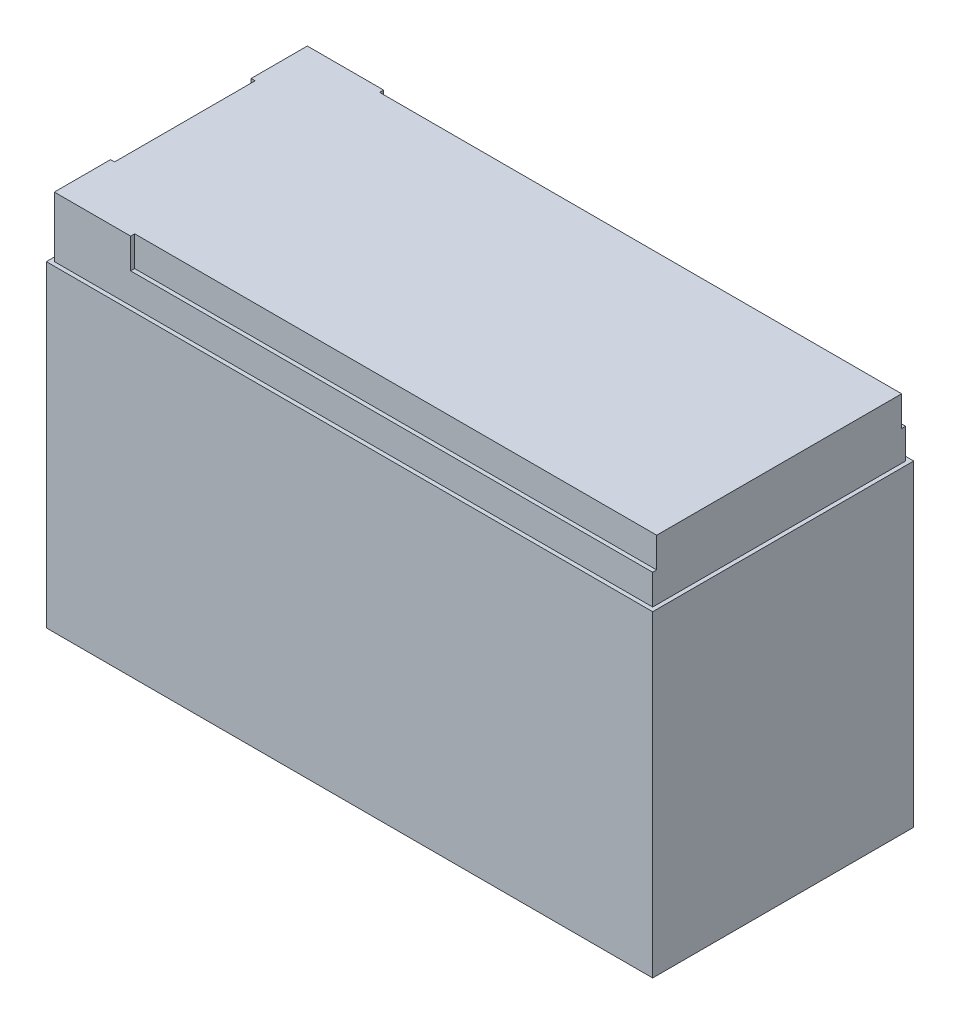
ISO-10303-21;
HEADER;
FILE_DESCRIPTION(('STEP AP214'),'2;1');
FILE_NAME('part.step','',(''),(''),'','','');
FILE_SCHEMA(('AUTOMOTIVE_DESIGN { 1 0 10303 214 1 1 1 1 }'));
ENDSEC;
DATA;
#1=APPLICATION_CONTEXT('core data for automotive mechanical design processes');
#2=APPLICATION_PROTOCOL_DEFINITION('international standard','automotive_design',2000,#1);
#3=PRODUCT_CONTEXT('',#1,'mechanical');
#4=PRODUCT('Part','Part','',(#3));
#5=PRODUCT_RELATED_PRODUCT_CATEGORY('part','',(#4));
#6=PRODUCT_DEFINITION_FORMATION('','',#4);
#7=PRODUCT_DEFINITION_CONTEXT('part definition',#1,'design');
#8=PRODUCT_DEFINITION('design','',#6,#7);
#9=PRODUCT_DEFINITION_SHAPE('','',#8);
#10=(LENGTH_UNIT() NAMED_UNIT(*) SI_UNIT(.MILLI.,.METRE.));
#11=(NAMED_UNIT(*) PLANE_ANGLE_UNIT() SI_UNIT($,.RADIAN.));
#12=(NAMED_UNIT(*) SI_UNIT($,.STERADIAN.) SOLID_ANGLE_UNIT());
#13=UNCERTAINTY_MEASURE_WITH_UNIT(LENGTH_MEASURE(1.E-05),#10,'distance_accuracy_value','');
#14=(GEOMETRIC_REPRESENTATION_CONTEXT(3) GLOBAL_UNCERTAINTY_ASSIGNED_CONTEXT((#13)) GLOBAL_UNIT_ASSIGNED_CONTEXT((#10,
#11,#12)) REPRESENTATION_CONTEXT('',''));
#15=CARTESIAN_POINT('',(0.,0.,0.));
#16=DIRECTION('',(0.,0.,1.));
#17=DIRECTION('',(1.,0.,0.));
#18=AXIS2_PLACEMENT_3D('',#15,#16,#17);
#19=CARTESIAN_POINT('',(75.5,94.,32.5));
#20=DIRECTION('',(-1.,0.,0.));
#21=DIRECTION('',(0.,0.,1.));
#22=AXIS2_PLACEMENT_3D('',#19,#20,#21);
#23=PLANE('',#22);
#24=DIRECTION('',(0.,0.,-1.));
#25=VECTOR('',#24,1.);
#26=CARTESIAN_POINT('',(75.5,79.,32.5));
#27=LINE('',#26,#25);
#28=CARTESIAN_POINT('',(75.5,79.,32.5));
#29=VERTEX_POINT('',#28);
#30=CARTESIAN_POINT('',(75.5,79.,-32.5));
#31=VERTEX_POINT('',#30);
#32=EDGE_CURVE('E269',#29,#31,#27,.T.);
#33=ORIENTED_EDGE('',*,*,#32,.F.);
#34=DIRECTION('',(0.,-1.,0.));
#35=VECTOR('',#34,1.);
#36=CARTESIAN_POINT('',(75.5,94.,32.5));
#37=LINE('',#36,#35);
#38=CARTESIAN_POINT('',(75.5,0.,32.5));
#39=VERTEX_POINT('',#38);
#40=EDGE_CURVE('E283',#29,#39,#37,.T.);
#41=ORIENTED_EDGE('',*,*,#40,.T.);
#42=DIRECTION('',(0.,0.,-1.));
#43=VECTOR('',#42,1.);
#44=CARTESIAN_POINT('',(75.5,0.,32.5));
#45=LINE('',#44,#43);
#46=CARTESIAN_POINT('',(75.5,0.,-32.5));
#47=VERTEX_POINT('',#46);
#48=EDGE_CURVE('E271',#39,#47,#45,.T.);
#49=ORIENTED_EDGE('',*,*,#48,.T.);
#50=DIRECTION('',(0.,-1.,0.));
#51=VECTOR('',#50,1.);
#52=CARTESIAN_POINT('',(75.5,94.,-32.5));
#53=LINE('',#52,#51);
#54=EDGE_CURVE('E11',#31,#47,#53,.T.);
#55=ORIENTED_EDGE('',*,*,#54,.F.);
#56=EDGE_LOOP('',(#33,#41,#49,#55));
#57=FACE_BOUND('',#56,.T.);
#58=ADVANCED_FACE('F32',(#57),#23,.F.);
#59=CARTESIAN_POINT('',(-75.5,94.,-32.5));
#60=DIRECTION('',(0.,0.,1.));
#61=DIRECTION('',(1.,0.,0.));
#62=AXIS2_PLACEMENT_3D('',#59,#60,#61);
#63=PLANE('',#62);
#64=DIRECTION('',(-1.,0.,0.));
#65=VECTOR('',#64,1.);
#66=CARTESIAN_POINT('',(75.5,79.,-32.5));
#67=LINE('',#66,#65);
#68=CARTESIAN_POINT('',(-75.5,79.,-32.5));
#69=VERTEX_POINT('',#68);
#70=EDGE_CURVE('E256',#31,#69,#67,.T.);
#71=ORIENTED_EDGE('',*,*,#70,.F.);
#72=ORIENTED_EDGE('',*,*,#54,.T.);
#73=DIRECTION('',(-1.,0.,0.));
#74=VECTOR('',#73,1.);
#75=CARTESIAN_POINT('',(-75.5,0.,-32.5));
#76=LINE('',#75,#74);
#77=CARTESIAN_POINT('',(-75.5,0.,-32.5));
#78=VERTEX_POINT('',#77);
#79=EDGE_CURVE('E274',#47,#78,#76,.T.);
#80=ORIENTED_EDGE('',*,*,#79,.T.);
#81=DIRECTION('',(0.,-1.,0.));
#82=VECTOR('',#81,1.);
#83=CARTESIAN_POINT('',(-75.5,94.,-32.5));
#84=LINE('',#83,#82);
#85=EDGE_CURVE('E39',#69,#78,#84,.T.);
#86=ORIENTED_EDGE('',*,*,#85,.F.);
#87=EDGE_LOOP('',(#71,#72,#80,#86));
#88=FACE_BOUND('',#87,.T.);
#89=ADVANCED_FACE('F296',(#88),#63,.F.);
#90=CARTESIAN_POINT('',(-75.5,94.,32.5));
#91=DIRECTION('',(1.,0.,0.));
#92=DIRECTION('',(0.,0.,-1.));
#93=AXIS2_PLACEMENT_3D('',#90,#91,#92);
#94=PLANE('',#93);
#95=DIRECTION('',(0.,0.,1.));
#96=VECTOR('',#95,1.);
#97=CARTESIAN_POINT('',(-75.5,79.,-32.5));
#98=LINE('',#97,#96);
#99=CARTESIAN_POINT('',(-75.5,79.,32.5));
#100=VERTEX_POINT('',#99);
#101=EDGE_CURVE('E265',#69,#100,#98,.T.);
#102=ORIENTED_EDGE('',*,*,#101,.F.);
#103=ORIENTED_EDGE('',*,*,#85,.T.);
#104=DIRECTION('',(0.,0.,1.));
#105=VECTOR('',#104,1.);
#106=CARTESIAN_POINT('',(-75.5,0.,32.5));
#107=LINE('',#106,#105);
#108=CARTESIAN_POINT('',(-75.5,0.,32.5));
#109=VERTEX_POINT('',#108);
#110=EDGE_CURVE('E277',#78,#109,#107,.T.);
#111=ORIENTED_EDGE('',*,*,#110,.T.);
#112=DIRECTION('',(0.,-1.,0.));
#113=VECTOR('',#112,1.);
#114=CARTESIAN_POINT('',(-75.5,94.,32.5));
#115=LINE('',#114,#113);
#116=EDGE_CURVE('E285',#100,#109,#115,.T.);
#117=ORIENTED_EDGE('',*,*,#116,.F.);
#118=EDGE_LOOP('',(#102,#103,#111,#117));
#119=FACE_BOUND('',#118,.T.);
#120=ADVANCED_FACE('F289',(#119),#94,.F.);
#121=CARTESIAN_POINT('',(-75.5,94.,32.5));
#122=DIRECTION('',(0.,0.,-1.));
#123=DIRECTION('',(-1.,0.,0.));
#124=AXIS2_PLACEMENT_3D('',#121,#122,#123);
#125=PLANE('',#124);
#126=DIRECTION('',(1.,0.,0.));
#127=VECTOR('',#126,1.);
#128=CARTESIAN_POINT('',(-75.5,79.,32.5));
#129=LINE('',#128,#127);
#130=EDGE_CURVE('E267',#100,#29,#129,.T.);
#131=ORIENTED_EDGE('',*,*,#130,.F.);
#132=ORIENTED_EDGE('',*,*,#116,.T.);
#133=DIRECTION('',(1.,0.,0.));
#134=VECTOR('',#133,1.);
#135=CARTESIAN_POINT('',(-75.5,0.,32.5));
#136=LINE('',#135,#134);
#137=EDGE_CURVE('E280',#109,#39,#136,.T.);
#138=ORIENTED_EDGE('',*,*,#137,.T.);
#139=ORIENTED_EDGE('',*,*,#40,.F.);
#140=EDGE_LOOP('',(#131,#132,#138,#139));
#141=FACE_BOUND('',#140,.T.);
#142=ADVANCED_FACE('F304',(#141),#125,.F.);
#143=CARTESIAN_POINT('',(0.,0.,0.));
#144=DIRECTION('',(0.,-1.,0.));
#145=DIRECTION('',(0.,0.,-1.));
#146=AXIS2_PLACEMENT_3D('',#143,#144,#145);
#147=PLANE('',#146);
#148=ORIENTED_EDGE('',*,*,#48,.F.);
#149=ORIENTED_EDGE('',*,*,#137,.F.);
#150=ORIENTED_EDGE('',*,*,#110,.F.);
#151=ORIENTED_EDGE('',*,*,#79,.F.);
#152=EDGE_LOOP('',(#148,#149,#150,#151));
#153=FACE_BOUND('',#152,.T.);
#154=ADVANCED_FACE('F300',(#153),#147,.T.);
#155=CARTESIAN_POINT('',(0.,79.,0.));
#156=DIRECTION('',(0.,1.,0.));
#157=DIRECTION('',(0.,0.,1.));
#158=AXIS2_PLACEMENT_3D('',#155,#156,#157);
#159=PLANE('',#158);
#160=DIRECTION('',(1.,0.,0.));
#161=VECTOR('',#160,1.);
#162=CARTESIAN_POINT('',(-74.5,79.,31.5));
#163=LINE('',#162,#161);
#164=CARTESIAN_POINT('',(-74.5,79.,31.5));
#165=VERTEX_POINT('',#164);
#166=CARTESIAN_POINT('',(74.5,79.,31.5));
#167=VERTEX_POINT('',#166);
#168=EDGE_CURVE('E241',#165,#167,#163,.T.);
#169=ORIENTED_EDGE('',*,*,#168,.F.);
#170=DIRECTION('',(0.,0.,1.));
#171=VECTOR('',#170,1.);
#172=CARTESIAN_POINT('',(-74.5,79.,31.5));
#173=LINE('',#172,#171);
#174=CARTESIAN_POINT('',(-74.5,79.,-31.5));
#175=VERTEX_POINT('',#174);
#176=EDGE_CURVE('E238',#175,#165,#173,.T.);
#177=ORIENTED_EDGE('',*,*,#176,.F.);
#178=DIRECTION('',(-1.,0.,0.));
#179=VECTOR('',#178,1.);
#180=CARTESIAN_POINT('',(-74.5,79.,-31.5));
#181=LINE('',#180,#179);
#182=CARTESIAN_POINT('',(74.5,79.,-31.5));
#183=VERTEX_POINT('',#182);
#184=EDGE_CURVE('E234',#183,#175,#181,.T.);
#185=ORIENTED_EDGE('',*,*,#184,.F.);
#186=DIRECTION('',(0.,0.,-1.));
#187=VECTOR('',#186,1.);
#188=CARTESIAN_POINT('',(74.5,79.,31.5));
#189=LINE('',#188,#187);
#190=EDGE_CURVE('E231',#167,#183,#189,.T.);
#191=ORIENTED_EDGE('',*,*,#190,.F.);
#192=EDGE_LOOP('',(#169,#177,#185,#191));
#193=FACE_BOUND('',#192,.T.);
#194=ORIENTED_EDGE('',*,*,#70,.T.);
#195=ORIENTED_EDGE('',*,*,#101,.T.);
#196=ORIENTED_EDGE('',*,*,#130,.T.);
#197=ORIENTED_EDGE('',*,*,#32,.T.);
#198=EDGE_LOOP('',(#194,#195,#196,#197));
#199=FACE_BOUND('',#198,.T.);
#200=ADVANCED_FACE('F307',(#193,#199),#159,.T.);
#201=CARTESIAN_POINT('',(74.5,79.,31.5));
#202=DIRECTION('',(1.,0.,0.));
#203=DIRECTION('',(0.,0.,-1.));
#204=AXIS2_PLACEMENT_3D('',#201,#202,#203);
#205=PLANE('',#204);
#206=DIRECTION('',(0.,1.,0.));
#207=VECTOR('',#206,1.);
#208=CARTESIAN_POINT('',(74.5,86.5,30.5));
#209=LINE('',#208,#207);
#210=CARTESIAN_POINT('',(74.5,86.5,30.5));
#211=VERTEX_POINT('',#210);
#212=CARTESIAN_POINT('',(74.5,94.,30.5));
#213=VERTEX_POINT('',#212);
#214=EDGE_CURVE('E54',#211,#213,#209,.T.);
#215=ORIENTED_EDGE('',*,*,#214,.F.);
#216=DIRECTION('',(0.,0.,-1.));
#217=VECTOR('',#216,1.);
#218=CARTESIAN_POINT('',(74.5,86.5,31.5));
#219=LINE('',#218,#217);
#220=CARTESIAN_POINT('',(74.5,86.5,31.5));
#221=VERTEX_POINT('',#220);
#222=EDGE_CURVE('E184',#221,#211,#219,.T.);
#223=ORIENTED_EDGE('',*,*,#222,.F.);
#224=DIRECTION('',(0.,1.,0.));
#225=VECTOR('',#224,1.);
#226=CARTESIAN_POINT('',(74.5,79.,31.5));
#227=LINE('',#226,#225);
#228=EDGE_CURVE('E253',#167,#221,#227,.T.);
#229=ORIENTED_EDGE('',*,*,#228,.F.);
#230=ORIENTED_EDGE('',*,*,#190,.T.);
#231=DIRECTION('',(0.,1.,0.));
#232=VECTOR('',#231,1.);
#233=CARTESIAN_POINT('',(74.5,79.,-31.5));
#234=LINE('',#233,#232);
#235=CARTESIAN_POINT('',(74.5,86.5,-31.5));
#236=VERTEX_POINT('',#235);
#237=EDGE_CURVE('E244',#183,#236,#234,.T.);
#238=ORIENTED_EDGE('',*,*,#237,.T.);
#239=DIRECTION('',(0.,0.,-1.));
#240=VECTOR('',#239,1.);
#241=CARTESIAN_POINT('',(74.5,86.5,-31.5));
#242=LINE('',#241,#240);
#243=CARTESIAN_POINT('',(74.5,86.5,-30.5));
#244=VERTEX_POINT('',#243);
#245=EDGE_CURVE('E207',#244,#236,#242,.T.);
#246=ORIENTED_EDGE('',*,*,#245,.F.);
#247=DIRECTION('',(0.,1.,0.));
#248=VECTOR('',#247,1.);
#249=CARTESIAN_POINT('',(74.5,86.5,-30.5));
#250=LINE('',#249,#248);
#251=CARTESIAN_POINT('',(74.5,94.,-30.5));
#252=VERTEX_POINT('',#251);
#253=EDGE_CURVE('E224',#244,#252,#250,.T.);
#254=ORIENTED_EDGE('',*,*,#253,.T.);
#255=DIRECTION('',(0.,0.,-1.));
#256=VECTOR('',#255,1.);
#257=CARTESIAN_POINT('',(74.5,94.,31.5));
#258=LINE('',#257,#256);
#259=EDGE_CURVE('E227',#213,#252,#258,.T.);
#260=ORIENTED_EDGE('',*,*,#259,.F.);
#261=EDGE_LOOP('',(#215,#223,#229,#230,#238,#246,#254,#260));
#262=FACE_BOUND('',#261,.T.);
#263=ADVANCED_FACE('F330',(#262),#205,.T.);
#264=CARTESIAN_POINT('',(-74.5,79.,31.5));
#265=DIRECTION('',(0.,0.,1.));
#266=DIRECTION('',(1.,0.,0.));
#267=AXIS2_PLACEMENT_3D('',#264,#265,#266);
#268=PLANE('',#267);
#269=DIRECTION('',(0.,1.,0.));
#270=VECTOR('',#269,1.);
#271=CARTESIAN_POINT('',(-55.5,86.5,31.5));
#272=LINE('',#271,#270);
#273=CARTESIAN_POINT('',(-55.5,86.5,31.5));
#274=VERTEX_POINT('',#273);
#275=CARTESIAN_POINT('',(-55.5,94.,31.5));
#276=VERTEX_POINT('',#275);
#277=EDGE_CURVE('E200',#274,#276,#272,.T.);
#278=ORIENTED_EDGE('',*,*,#277,.T.);
#279=DIRECTION('',(1.,0.,0.));
#280=VECTOR('',#279,1.);
#281=CARTESIAN_POINT('',(-74.5,94.,31.5));
#282=LINE('',#281,#280);
#283=CARTESIAN_POINT('',(-74.5,94.,31.5));
#284=VERTEX_POINT('',#283);
#285=EDGE_CURVE('E235',#284,#276,#282,.T.);
#286=ORIENTED_EDGE('',*,*,#285,.F.);
#287=DIRECTION('',(0.,1.,0.));
#288=VECTOR('',#287,1.);
#289=CARTESIAN_POINT('',(-74.5,79.,31.5));
#290=LINE('',#289,#288);
#291=EDGE_CURVE('E257',#165,#284,#290,.T.);
#292=ORIENTED_EDGE('',*,*,#291,.F.);
#293=ORIENTED_EDGE('',*,*,#168,.T.);
#294=ORIENTED_EDGE('',*,*,#228,.T.);
#295=DIRECTION('',(1.,0.,0.));
#296=VECTOR('',#295,1.);
#297=CARTESIAN_POINT('',(74.5,86.5,31.5));
#298=LINE('',#297,#296);
#299=EDGE_CURVE('E194',#274,#221,#298,.T.);
#300=ORIENTED_EDGE('',*,*,#299,.F.);
#301=EDGE_LOOP('',(#278,#286,#292,#293,#294,#300));
#302=FACE_BOUND('',#301,.T.);
#303=ADVANCED_FACE('F334',(#302),#268,.T.);
#304=CARTESIAN_POINT('',(-74.5,79.,31.5));
#305=DIRECTION('',(-1.,0.,0.));
#306=DIRECTION('',(0.,0.,1.));
#307=AXIS2_PLACEMENT_3D('',#304,#305,#306);
#308=PLANE('',#307);
#309=DIRECTION('',(0.,1.,0.));
#310=VECTOR('',#309,1.);
#311=CARTESIAN_POINT('',(-74.5,86.5,-17.5));
#312=LINE('',#311,#310);
#313=CARTESIAN_POINT('',(-74.5,86.5,-17.5));
#314=VERTEX_POINT('',#313);
#315=CARTESIAN_POINT('',(-74.5,94.,-17.5));
#316=VERTEX_POINT('',#315);
#317=EDGE_CURVE('E198',#314,#316,#312,.T.);
#318=ORIENTED_EDGE('',*,*,#317,.T.);
#319=DIRECTION('',(0.,0.,1.));
#320=VECTOR('',#319,1.);
#321=CARTESIAN_POINT('',(-74.5,94.,31.5));
#322=LINE('',#321,#320);
#323=CARTESIAN_POINT('',(-74.5,94.,-31.5));
#324=VERTEX_POINT('',#323);
#325=EDGE_CURVE('E248',#324,#316,#322,.T.);
#326=ORIENTED_EDGE('',*,*,#325,.F.);
#327=DIRECTION('',(0.,1.,0.));
#328=VECTOR('',#327,1.);
#329=CARTESIAN_POINT('',(-74.5,79.,-31.5));
#330=LINE('',#329,#328);
#331=EDGE_CURVE('E259',#175,#324,#330,.T.);
#332=ORIENTED_EDGE('',*,*,#331,.F.);
#333=ORIENTED_EDGE('',*,*,#176,.T.);
#334=ORIENTED_EDGE('',*,*,#291,.T.);
#335=CARTESIAN_POINT('',(-74.5,94.,17.5));
#336=VERTEX_POINT('',#335);
#337=EDGE_CURVE('E177',#336,#284,#322,.T.);
#338=ORIENTED_EDGE('',*,*,#337,.F.);
#339=DIRECTION('',(0.,1.,0.));
#340=VECTOR('',#339,1.);
#341=CARTESIAN_POINT('',(-74.5,86.5,17.5));
#342=LINE('',#341,#340);
#343=CARTESIAN_POINT('',(-74.5,86.5,17.5));
#344=VERTEX_POINT('',#343);
#345=EDGE_CURVE('E46',#344,#336,#342,.T.);
#346=ORIENTED_EDGE('',*,*,#345,.F.);
#347=DIRECTION('',(0.,0.,1.));
#348=VECTOR('',#347,1.);
#349=CARTESIAN_POINT('',(-74.5,86.5,-17.5));
#350=LINE('',#349,#348);
#351=EDGE_CURVE('E163',#314,#344,#350,.T.);
#352=ORIENTED_EDGE('',*,*,#351,.F.);
#353=EDGE_LOOP('',(#318,#326,#332,#333,#334,#338,#346,#352));
#354=FACE_BOUND('',#353,.T.);
#355=ADVANCED_FACE('F175',(#354),#308,.T.);
#356=CARTESIAN_POINT('',(-74.5,79.,-31.5));
#357=DIRECTION('',(0.,0.,-1.));
#358=DIRECTION('',(-1.,0.,0.));
#359=AXIS2_PLACEMENT_3D('',#356,#357,#358);
#360=PLANE('',#359);
#361=DIRECTION('',(0.,1.,0.));
#362=VECTOR('',#361,1.);
#363=CARTESIAN_POINT('',(-55.5,86.5,-31.5));
#364=LINE('',#363,#362);
#365=CARTESIAN_POINT('',(-55.5,86.5,-31.5));
#366=VERTEX_POINT('',#365);
#367=CARTESIAN_POINT('',(-55.5,94.,-31.5));
#368=VERTEX_POINT('',#367);
#369=EDGE_CURVE('E219',#366,#368,#364,.T.);
#370=ORIENTED_EDGE('',*,*,#369,.F.);
#371=DIRECTION('',(-1.,0.,0.));
#372=VECTOR('',#371,1.);
#373=CARTESIAN_POINT('',(74.5,86.5,-31.5));
#374=LINE('',#373,#372);
#375=EDGE_CURVE('E209',#236,#366,#374,.T.);
#376=ORIENTED_EDGE('',*,*,#375,.F.);
#377=ORIENTED_EDGE('',*,*,#237,.F.);
#378=ORIENTED_EDGE('',*,*,#184,.T.);
#379=ORIENTED_EDGE('',*,*,#331,.T.);
#380=DIRECTION('',(-1.,0.,0.));
#381=VECTOR('',#380,1.);
#382=CARTESIAN_POINT('',(-74.5,94.,-31.5));
#383=LINE('',#382,#381);
#384=EDGE_CURVE('E246',#368,#324,#383,.T.);
#385=ORIENTED_EDGE('',*,*,#384,.F.);
#386=EDGE_LOOP('',(#370,#376,#377,#378,#379,#385));
#387=FACE_BOUND('',#386,.T.);
#388=ADVANCED_FACE('F326',(#387),#360,.T.);
#389=CARTESIAN_POINT('',(0.,94.,0.));
#390=DIRECTION('',(0.,-1.,0.));
#391=DIRECTION('',(0.,0.,-1.));
#392=AXIS2_PLACEMENT_3D('',#389,#390,#391);
#393=PLANE('',#392);
#394=ORIENTED_EDGE('',*,*,#325,.T.);
#395=DIRECTION('',(-1.,0.,0.));
#396=VECTOR('',#395,1.);
#397=CARTESIAN_POINT('',(-74.5,94.,-17.5));
#398=LINE('',#397,#396);
#399=CARTESIAN_POINT('',(-73.5,94.,-17.5));
#400=VERTEX_POINT('',#399);
#401=EDGE_CURVE('E172',#400,#316,#398,.T.);
#402=ORIENTED_EDGE('',*,*,#401,.F.);
#403=DIRECTION('',(0.,0.,-1.));
#404=VECTOR('',#403,1.);
#405=CARTESIAN_POINT('',(-73.5,94.,-17.5));
#406=LINE('',#405,#404);
#407=CARTESIAN_POINT('',(-73.5,94.,17.5));
#408=VERTEX_POINT('',#407);
#409=EDGE_CURVE('E502',#408,#400,#406,.T.);
#410=ORIENTED_EDGE('',*,*,#409,.F.);
#411=DIRECTION('',(1.,0.,0.));
#412=VECTOR('',#411,1.);
#413=CARTESIAN_POINT('',(-74.5,94.,17.5));
#414=LINE('',#413,#412);
#415=EDGE_CURVE('E518',#336,#408,#414,.T.);
#416=ORIENTED_EDGE('',*,*,#415,.F.);
#417=ORIENTED_EDGE('',*,*,#337,.T.);
#418=ORIENTED_EDGE('',*,*,#285,.T.);
#419=DIRECTION('',(0.,0.,1.));
#420=VECTOR('',#419,1.);
#421=CARTESIAN_POINT('',(-55.5,94.,31.5));
#422=LINE('',#421,#420);
#423=CARTESIAN_POINT('',(-55.5,94.,30.5));
#424=VERTEX_POINT('',#423);
#425=EDGE_CURVE('E188',#424,#276,#422,.T.);
#426=ORIENTED_EDGE('',*,*,#425,.F.);
#427=DIRECTION('',(-1.,0.,0.));
#428=VECTOR('',#427,1.);
#429=CARTESIAN_POINT('',(74.5,94.,30.5));
#430=LINE('',#429,#428);
#431=EDGE_CURVE('E196',#213,#424,#430,.T.);
#432=ORIENTED_EDGE('',*,*,#431,.F.);
#433=ORIENTED_EDGE('',*,*,#259,.T.);
#434=DIRECTION('',(1.,0.,0.));
#435=VECTOR('',#434,1.);
#436=CARTESIAN_POINT('',(74.5,94.,-30.5));
#437=LINE('',#436,#435);
#438=CARTESIAN_POINT('',(-55.5,94.,-30.5));
#439=VERTEX_POINT('',#438);
#440=EDGE_CURVE('E210',#439,#252,#437,.T.);
#441=ORIENTED_EDGE('',*,*,#440,.F.);
#442=DIRECTION('',(0.,0.,1.));
#443=VECTOR('',#442,1.);
#444=CARTESIAN_POINT('',(-55.5,94.,-31.5));
#445=LINE('',#444,#443);
#446=EDGE_CURVE('E203',#368,#439,#445,.T.);
#447=ORIENTED_EDGE('',*,*,#446,.F.);
#448=ORIENTED_EDGE('',*,*,#384,.T.);
#449=EDGE_LOOP('',(#394,#402,#410,#416,#417,#418,#426,#432,#433,#441,#447,#448));
#450=FACE_BOUND('',#449,.T.);
#451=ADVANCED_FACE('F322',(#450),#393,.F.);
#452=CARTESIAN_POINT('',(74.5,86.5,-30.5));
#453=DIRECTION('',(0.,0.,1.));
#454=DIRECTION('',(1.,0.,0.));
#455=AXIS2_PLACEMENT_3D('',#452,#453,#454);
#456=PLANE('',#455);
#457=ORIENTED_EDGE('',*,*,#440,.T.);
#458=ORIENTED_EDGE('',*,*,#253,.F.);
#459=DIRECTION('',(1.,0.,0.));
#460=VECTOR('',#459,1.);
#461=CARTESIAN_POINT('',(74.5,86.5,-30.5));
#462=LINE('',#461,#460);
#463=CARTESIAN_POINT('',(-55.5,86.5,-30.5));
#464=VERTEX_POINT('',#463);
#465=EDGE_CURVE('E216',#464,#244,#462,.T.);
#466=ORIENTED_EDGE('',*,*,#465,.F.);
#467=DIRECTION('',(0.,1.,0.));
#468=VECTOR('',#467,1.);
#469=CARTESIAN_POINT('',(-55.5,86.5,-30.5));
#470=LINE('',#469,#468);
#471=EDGE_CURVE('E228',#464,#439,#470,.T.);
#472=ORIENTED_EDGE('',*,*,#471,.T.);
#473=EDGE_LOOP('',(#457,#458,#466,#472));
#474=FACE_BOUND('',#473,.T.);
#475=ADVANCED_FACE('F325',(#474),#456,.F.);
#476=CARTESIAN_POINT('',(-55.5,86.5,-31.5));
#477=DIRECTION('',(-1.,0.,0.));
#478=DIRECTION('',(0.,0.,1.));
#479=AXIS2_PLACEMENT_3D('',#476,#477,#478);
#480=PLANE('',#479);
#481=ORIENTED_EDGE('',*,*,#446,.T.);
#482=ORIENTED_EDGE('',*,*,#471,.F.);
#483=DIRECTION('',(0.,0.,1.));
#484=VECTOR('',#483,1.);
#485=CARTESIAN_POINT('',(-55.5,86.5,-31.5));
#486=LINE('',#485,#484);
#487=EDGE_CURVE('E213',#366,#464,#486,.T.);
#488=ORIENTED_EDGE('',*,*,#487,.F.);
#489=ORIENTED_EDGE('',*,*,#369,.T.);
#490=EDGE_LOOP('',(#481,#482,#488,#489));
#491=FACE_BOUND('',#490,.T.);
#492=ADVANCED_FACE('F344',(#491),#480,.F.);
#493=CARTESIAN_POINT('',(0.,86.5,0.));
#494=DIRECTION('',(0.,-1.,0.));
#495=DIRECTION('',(0.,0.,-1.));
#496=AXIS2_PLACEMENT_3D('',#493,#494,#495);
#497=PLANE('',#496);
#498=ORIENTED_EDGE('',*,*,#245,.T.);
#499=ORIENTED_EDGE('',*,*,#375,.T.);
#500=ORIENTED_EDGE('',*,*,#487,.T.);
#501=ORIENTED_EDGE('',*,*,#465,.T.);
#502=EDGE_LOOP('',(#498,#499,#500,#501));
#503=FACE_BOUND('',#502,.T.);
#504=ADVANCED_FACE('F347',(#503),#497,.F.);
#505=CARTESIAN_POINT('',(-55.5,86.5,31.5));
#506=DIRECTION('',(-1.,0.,0.));
#507=DIRECTION('',(0.,0.,1.));
#508=AXIS2_PLACEMENT_3D('',#505,#506,#507);
#509=PLANE('',#508);
#510=ORIENTED_EDGE('',*,*,#425,.T.);
#511=ORIENTED_EDGE('',*,*,#277,.F.);
#512=DIRECTION('',(0.,0.,1.));
#513=VECTOR('',#512,1.);
#514=CARTESIAN_POINT('',(-55.5,86.5,31.5));
#515=LINE('',#514,#513);
#516=CARTESIAN_POINT('',(-55.5,86.5,30.5));
#517=VERTEX_POINT('',#516);
#518=EDGE_CURVE('E191',#517,#274,#515,.T.);
#519=ORIENTED_EDGE('',*,*,#518,.F.);
#520=DIRECTION('',(0.,1.,0.));
#521=VECTOR('',#520,1.);
#522=CARTESIAN_POINT('',(-55.5,86.5,30.5));
#523=LINE('',#522,#521);
#524=EDGE_CURVE('E204',#517,#424,#523,.T.);
#525=ORIENTED_EDGE('',*,*,#524,.T.);
#526=EDGE_LOOP('',(#510,#511,#519,#525));
#527=FACE_BOUND('',#526,.T.);
#528=ADVANCED_FACE('F354',(#527),#509,.F.);
#529=CARTESIAN_POINT('',(74.5,86.5,30.5));
#530=DIRECTION('',(0.,0.,-1.));
#531=DIRECTION('',(-1.,0.,0.));
#532=AXIS2_PLACEMENT_3D('',#529,#530,#531);
#533=PLANE('',#532);
#534=ORIENTED_EDGE('',*,*,#431,.T.);
#535=ORIENTED_EDGE('',*,*,#524,.F.);
#536=DIRECTION('',(-1.,0.,0.));
#537=VECTOR('',#536,1.);
#538=CARTESIAN_POINT('',(74.5,86.5,30.5));
#539=LINE('',#538,#537);
#540=EDGE_CURVE('E187',#211,#517,#539,.T.);
#541=ORIENTED_EDGE('',*,*,#540,.F.);
#542=ORIENTED_EDGE('',*,*,#214,.T.);
#543=EDGE_LOOP('',(#534,#535,#541,#542));
#544=FACE_BOUND('',#543,.T.);
#545=ADVANCED_FACE('F356',(#544),#533,.F.);
#546=CARTESIAN_POINT('',(0.,86.5,0.));
#547=DIRECTION('',(0.,1.,0.));
#548=DIRECTION('',(0.,0.,1.));
#549=AXIS2_PLACEMENT_3D('',#546,#547,#548);
#550=PLANE('',#549);
#551=ORIENTED_EDGE('',*,*,#222,.T.);
#552=ORIENTED_EDGE('',*,*,#540,.T.);
#553=ORIENTED_EDGE('',*,*,#518,.T.);
#554=ORIENTED_EDGE('',*,*,#299,.T.);
#555=EDGE_LOOP('',(#551,#552,#553,#554));
#556=FACE_BOUND('',#555,.T.);
#557=ADVANCED_FACE('F359',(#556),#550,.T.);
#558=CARTESIAN_POINT('',(-74.5,86.5,-17.5));
#559=DIRECTION('',(0.,0.,-1.));
#560=DIRECTION('',(-1.,0.,0.));
#561=AXIS2_PLACEMENT_3D('',#558,#559,#560);
#562=PLANE('',#561);
#563=ORIENTED_EDGE('',*,*,#401,.T.);
#564=ORIENTED_EDGE('',*,*,#317,.F.);
#565=DIRECTION('',(-1.,0.,0.));
#566=VECTOR('',#565,1.);
#567=CARTESIAN_POINT('',(-74.5,86.5,-17.5));
#568=LINE('',#567,#566);
#569=CARTESIAN_POINT('',(-73.5,86.5,-17.5));
#570=VERTEX_POINT('',#569);
#571=EDGE_CURVE('E169',#570,#314,#568,.T.);
#572=ORIENTED_EDGE('',*,*,#571,.F.);
#573=DIRECTION('',(0.,1.,0.));
#574=VECTOR('',#573,1.);
#575=CARTESIAN_POINT('',(-73.5,86.5,-17.5));
#576=LINE('',#575,#574);
#577=EDGE_CURVE('E179',#570,#400,#576,.T.);
#578=ORIENTED_EDGE('',*,*,#577,.T.);
#579=EDGE_LOOP('',(#563,#564,#572,#578));
#580=FACE_BOUND('',#579,.T.);
#581=ADVANCED_FACE('F365',(#580),#562,.F.);
#582=CARTESIAN_POINT('',(-73.5,86.5,-17.5));
#583=DIRECTION('',(1.,0.,0.));
#584=DIRECTION('',(0.,0.,-1.));
#585=AXIS2_PLACEMENT_3D('',#582,#583,#584);
#586=PLANE('',#585);
#587=ORIENTED_EDGE('',*,*,#409,.T.);
#588=ORIENTED_EDGE('',*,*,#577,.F.);
#589=DIRECTION('',(0.,0.,-1.));
#590=VECTOR('',#589,1.);
#591=CARTESIAN_POINT('',(-73.5,86.5,-17.5));
#592=LINE('',#591,#590);
#593=CARTESIAN_POINT('',(-73.5,86.5,17.5));
#594=VERTEX_POINT('',#593);
#595=EDGE_CURVE('E162',#594,#570,#592,.T.);
#596=ORIENTED_EDGE('',*,*,#595,.F.);
#597=DIRECTION('',(0.,1.,0.));
#598=VECTOR('',#597,1.);
#599=CARTESIAN_POINT('',(-73.5,86.5,17.5));
#600=LINE('',#599,#598);
#601=EDGE_CURVE('E158',#594,#408,#600,.T.);
#602=ORIENTED_EDGE('',*,*,#601,.T.);
#603=EDGE_LOOP('',(#587,#588,#596,#602));
#604=FACE_BOUND('',#603,.T.);
#605=ADVANCED_FACE('F369',(#604),#586,.F.);
#606=CARTESIAN_POINT('',(-74.5,86.5,17.5));
#607=DIRECTION('',(0.,0.,1.));
#608=DIRECTION('',(1.,0.,0.));
#609=AXIS2_PLACEMENT_3D('',#606,#607,#608);
#610=PLANE('',#609);
#611=ORIENTED_EDGE('',*,*,#415,.T.);
#612=ORIENTED_EDGE('',*,*,#601,.F.);
#613=DIRECTION('',(1.,0.,0.));
#614=VECTOR('',#613,1.);
#615=CARTESIAN_POINT('',(-74.5,86.5,17.5));
#616=LINE('',#615,#614);
#617=EDGE_CURVE('E155',#344,#594,#616,.T.);
#618=ORIENTED_EDGE('',*,*,#617,.F.);
#619=ORIENTED_EDGE('',*,*,#345,.T.);
#620=EDGE_LOOP('',(#611,#612,#618,#619));
#621=FACE_BOUND('',#620,.T.);
#622=ADVANCED_FACE('F157',(#621),#610,.F.);
#623=CARTESIAN_POINT('',(0.,86.5,0.));
#624=DIRECTION('',(0.,1.,0.));
#625=DIRECTION('',(0.,0.,1.));
#626=AXIS2_PLACEMENT_3D('',#623,#624,#625);
#627=PLANE('',#626);
#628=ORIENTED_EDGE('',*,*,#351,.T.);
#629=ORIENTED_EDGE('',*,*,#617,.T.);
#630=ORIENTED_EDGE('',*,*,#595,.T.);
#631=ORIENTED_EDGE('',*,*,#571,.T.);
#632=EDGE_LOOP('',(#628,#629,#630,#631));
#633=FACE_BOUND('',#632,.T.);
#634=ADVANCED_FACE('F167',(#633),#627,.T.);
#635=CLOSED_SHELL('',(#58,#89,#120,#142,#154,#200,#263,#303,#355,#388,#451,#475,#492,#504,#528,
#545,#557,#581,#605,#622,#634));
#636=MANIFOLD_SOLID_BREP('B2',#635);
#637=ADVANCED_BREP_SHAPE_REPRESENTATION('',(#18,#636),#14);
#638=SHAPE_DEFINITION_REPRESENTATION(#9,#637);
ENDSEC;
END-ISO-10303-21;
